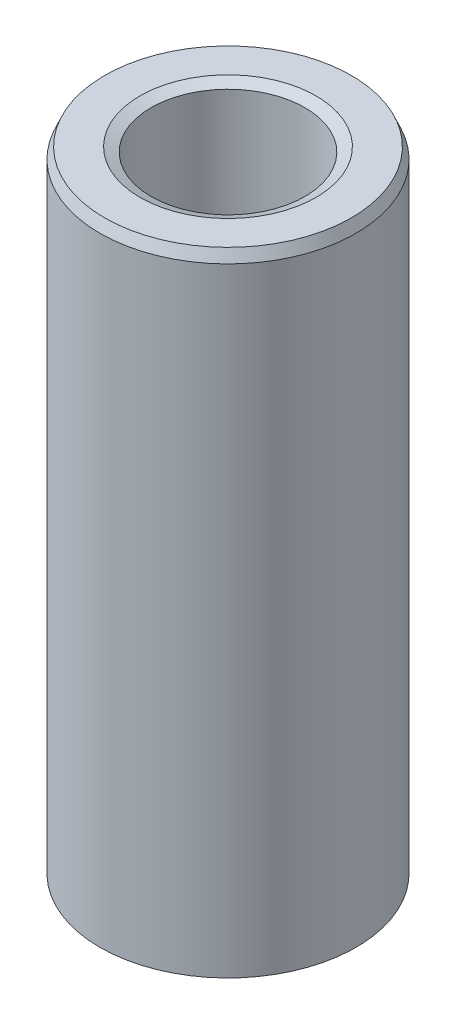
ISO-10303-21;
HEADER;
FILE_DESCRIPTION(('STEP AP214'),'2;1');
FILE_NAME('part.step','',(''),(''),'','','');
FILE_SCHEMA(('AUTOMOTIVE_DESIGN { 1 0 10303 214 1 1 1 1 }'));
ENDSEC;
DATA;
#1=APPLICATION_CONTEXT('core data for automotive mechanical design processes');
#2=APPLICATION_PROTOCOL_DEFINITION('international standard','automotive_design',2000,#1);
#3=PRODUCT_CONTEXT('',#1,'mechanical');
#4=PRODUCT('Part','Part','',(#3));
#5=PRODUCT_RELATED_PRODUCT_CATEGORY('part','',(#4));
#6=PRODUCT_DEFINITION_FORMATION('','',#4);
#7=PRODUCT_DEFINITION_CONTEXT('part definition',#1,'design');
#8=PRODUCT_DEFINITION('design','',#6,#7);
#9=PRODUCT_DEFINITION_SHAPE('','',#8);
#10=(LENGTH_UNIT() NAMED_UNIT(*) SI_UNIT(.MILLI.,.METRE.));
#11=(NAMED_UNIT(*) PLANE_ANGLE_UNIT() SI_UNIT($,.RADIAN.));
#12=(NAMED_UNIT(*) SI_UNIT($,.STERADIAN.) SOLID_ANGLE_UNIT());
#13=UNCERTAINTY_MEASURE_WITH_UNIT(LENGTH_MEASURE(1.E-05),#10,'distance_accuracy_value','');
#14=(GEOMETRIC_REPRESENTATION_CONTEXT(3) GLOBAL_UNCERTAINTY_ASSIGNED_CONTEXT((#13)) GLOBAL_UNIT_ASSIGNED_CONTEXT((#10,
#11,#12)) REPRESENTATION_CONTEXT('',''));
#15=CARTESIAN_POINT('',(0.,0.,0.));
#16=DIRECTION('',(0.,0.,1.));
#17=DIRECTION('',(1.,0.,0.));
#18=AXIS2_PLACEMENT_3D('',#15,#16,#17);
#19=CARTESIAN_POINT('',(0.,185.728124126698,0.));
#20=DIRECTION('',(0.,-1.,0.));
#21=DIRECTION('',(0.,0.,-1.));
#22=AXIS2_PLACEMENT_3D('',#19,#20,#21);
#23=CYLINDRICAL_SURFACE('',#22,37.5);
#24=CARTESIAN_POINT('',(0.,1.37318236492334,0.));
#25=DIRECTION('',(0.,1.,0.));
#26=DIRECTION('',(0.,0.,1.));
#27=AXIS2_PLACEMENT_3D('',#24,#25,#26);
#28=CIRCLE('',#27,37.5);
#29=CARTESIAN_POINT('',(0.,1.37318236492334,37.5));
#30=VERTEX_POINT('',#29);
#31=EDGE_CURVE('E10',#30,#30,#28,.T.);
#32=ORIENTED_EDGE('',*,*,#31,.T.);
#33=EDGE_LOOP('',(#32));
#34=FACE_BOUND('',#33,.T.);
#35=CARTESIAN_POINT('',(0.,182.495355527139,0.));
#36=DIRECTION('',(0.,1.,0.));
#37=DIRECTION('',(0.,0.,1.));
#38=AXIS2_PLACEMENT_3D('',#35,#36,#37);
#39=CIRCLE('',#38,37.5);
#40=CARTESIAN_POINT('',(0.,182.495355527139,37.5));
#41=VERTEX_POINT('',#40);
#42=EDGE_CURVE('E50',#41,#41,#39,.F.);
#43=ORIENTED_EDGE('',*,*,#42,.T.);
#44=EDGE_LOOP('',(#43));
#45=FACE_BOUND('',#44,.T.);
#46=ADVANCED_FACE('F39',(#34,#45),#23,.T.);
#47=CARTESIAN_POINT('',(0.,185.728124126698,0.));
#48=DIRECTION('',(0.,1.,0.));
#49=DIRECTION('',(0.,0.,1.));
#50=AXIS2_PLACEMENT_3D('',#47,#48,#49);
#51=PLANE('',#50);
#52=CARTESIAN_POINT('',(0.,185.728124126698,0.));
#53=DIRECTION('',(0.,1.,0.));
#54=DIRECTION('',(0.,0.,1.));
#55=AXIS2_PLACEMENT_3D('',#52,#53,#54);
#56=CIRCLE('',#55,25.7764049885454);
#57=CARTESIAN_POINT('',(0.,185.728124126698,25.7764049885454));
#58=VERTEX_POINT('',#57);
#59=EDGE_CURVE('E58',#58,#58,#56,.F.);
#60=ORIENTED_EDGE('',*,*,#59,.T.);
#61=EDGE_LOOP('',(#60));
#62=FACE_BOUND('',#61,.T.);
#63=CARTESIAN_POINT('',(0.,185.728124126698,0.));
#64=DIRECTION('',(0.,1.,0.));
#65=DIRECTION('',(0.,0.,1.));
#66=AXIS2_PLACEMENT_3D('',#63,#64,#65);
#67=CIRCLE('',#66,36.1268176350767);
#68=CARTESIAN_POINT('',(0.,185.728124126698,36.1268176350767));
#69=VERTEX_POINT('',#68);
#70=EDGE_CURVE('E61',#69,#69,#67,.T.);
#71=ORIENTED_EDGE('',*,*,#70,.T.);
#72=EDGE_LOOP('',(#71));
#73=FACE_BOUND('',#72,.T.);
#74=ADVANCED_FACE('F88',(#62,#73),#51,.T.);
#75=CARTESIAN_POINT('',(0.,0.,0.));
#76=DIRECTION('',(0.,1.,0.));
#77=DIRECTION('',(0.,0.,1.));
#78=AXIS2_PLACEMENT_3D('',#75,#76,#77);
#79=PLANE('',#78);
#80=CARTESIAN_POINT('',(0.,0.,0.));
#81=DIRECTION('',(0.,1.,0.));
#82=DIRECTION('',(0.,0.,1.));
#83=AXIS2_PLACEMENT_3D('',#80,#81,#82);
#84=CIRCLE('',#83,23.91681875391);
#85=CARTESIAN_POINT('',(0.,0.,23.91681875391));
#86=VERTEX_POINT('',#85);
#87=EDGE_CURVE('E51',#86,#86,#84,.T.);
#88=ORIENTED_EDGE('',*,*,#87,.T.);
#89=EDGE_LOOP('',(#88));
#90=FACE_BOUND('',#89,.T.);
#91=CARTESIAN_POINT('',(0.,0.,0.));
#92=DIRECTION('',(0.,1.,0.));
#93=DIRECTION('',(0.,0.,1.));
#94=AXIS2_PLACEMENT_3D('',#91,#92,#93);
#95=CIRCLE('',#94,34.2672314004412);
#96=CARTESIAN_POINT('',(0.,0.,34.2672314004412));
#97=VERTEX_POINT('',#96);
#98=EDGE_CURVE('E54',#97,#97,#95,.F.);
#99=ORIENTED_EDGE('',*,*,#98,.T.);
#100=EDGE_LOOP('',(#99));
#101=FACE_BOUND('',#100,.T.);
#102=ADVANCED_FACE('F83',(#90,#101),#79,.F.);
#103=CARTESIAN_POINT('',(0.,185.728124126698,0.));
#104=DIRECTION('',(0.,-1.,0.));
#105=DIRECTION('',(0.,0.,-1.));
#106=AXIS2_PLACEMENT_3D('',#103,#104,#105);
#107=CYLINDRICAL_SURFACE('',#106,22.5436363889867);
#108=CARTESIAN_POINT('',(0.,184.354941761775,0.));
#109=DIRECTION('',(0.,1.,0.));
#110=DIRECTION('',(0.,0.,1.));
#111=AXIS2_PLACEMENT_3D('',#108,#109,#110);
#112=CIRCLE('',#111,22.5436363889867);
#113=CARTESIAN_POINT('',(0.,184.354941761775,22.5436363889867));
#114=VERTEX_POINT('',#113);
#115=EDGE_CURVE('E67',#114,#114,#112,.T.);
#116=ORIENTED_EDGE('',*,*,#115,.T.);
#117=EDGE_LOOP('',(#116));
#118=FACE_BOUND('',#117,.T.);
#119=CARTESIAN_POINT('',(0.,3.23276859955884,0.));
#120=DIRECTION('',(0.,1.,0.));
#121=DIRECTION('',(0.,0.,1.));
#122=AXIS2_PLACEMENT_3D('',#119,#120,#121);
#123=CIRCLE('',#122,22.5436363889867);
#124=CARTESIAN_POINT('',(0.,3.23276859955884,22.5436363889867));
#125=VERTEX_POINT('',#124);
#126=EDGE_CURVE('E69',#125,#125,#123,.F.);
#127=ORIENTED_EDGE('',*,*,#126,.T.);
#128=EDGE_LOOP('',(#127));
#129=FACE_BOUND('',#128,.T.);
#130=ADVANCED_FACE('F71',(#118,#129),#107,.F.);
#131=CARTESIAN_POINT('',(0.,184.354941761775,0.));
#132=DIRECTION('',(0.,1.,0.));
#133=DIRECTION('',(0.,0.,1.));
#134=AXIS2_PLACEMENT_3D('',#131,#132,#133);
#135=CONICAL_SURFACE('',#134,22.5436363889867,1.16912070490601);
#136=ORIENTED_EDGE('',*,*,#59,.F.);
#137=EDGE_LOOP('',(#136));
#138=FACE_BOUND('',#137,.T.);
#139=ORIENTED_EDGE('',*,*,#115,.F.);
#140=EDGE_LOOP('',(#139));
#141=FACE_BOUND('',#140,.T.);
#142=ADVANCED_FACE('F77',(#138,#141),#135,.F.);
#143=CARTESIAN_POINT('',(0.,0.,0.));
#144=DIRECTION('',(0.,-1.,0.));
#145=DIRECTION('',(0.,0.,-1.));
#146=AXIS2_PLACEMENT_3D('',#143,#144,#145);
#147=CONICAL_SURFACE('',#146,23.91681875391,0.401675621888879);
#148=ORIENTED_EDGE('',*,*,#126,.F.);
#149=EDGE_LOOP('',(#148));
#150=FACE_BOUND('',#149,.T.);
#151=ORIENTED_EDGE('',*,*,#87,.F.);
#152=EDGE_LOOP('',(#151));
#153=FACE_BOUND('',#152,.T.);
#154=ADVANCED_FACE('F73',(#150,#153),#147,.F.);
#155=CARTESIAN_POINT('',(0.,1.37318236492334,0.));
#156=DIRECTION('',(0.,1.,0.));
#157=DIRECTION('',(0.,0.,1.));
#158=AXIS2_PLACEMENT_3D('',#155,#156,#157);
#159=CONICAL_SURFACE('',#158,37.5,1.16912070490602);
#160=ORIENTED_EDGE('',*,*,#98,.F.);
#161=EDGE_LOOP('',(#160));
#162=FACE_BOUND('',#161,.T.);
#163=ORIENTED_EDGE('',*,*,#31,.F.);
#164=EDGE_LOOP('',(#163));
#165=FACE_BOUND('',#164,.T.);
#166=ADVANCED_FACE('F76',(#162,#165),#159,.T.);
#167=CARTESIAN_POINT('',(0.,185.728124126698,0.));
#168=DIRECTION('',(0.,-1.,0.));
#169=DIRECTION('',(0.,0.,-1.));
#170=AXIS2_PLACEMENT_3D('',#167,#168,#169);
#171=CONICAL_SURFACE('',#170,36.1268176350767,0.40167562188888);
#172=ORIENTED_EDGE('',*,*,#42,.F.);
#173=EDGE_LOOP('',(#172));
#174=FACE_BOUND('',#173,.T.);
#175=ORIENTED_EDGE('',*,*,#70,.F.);
#176=EDGE_LOOP('',(#175));
#177=FACE_BOUND('',#176,.T.);
#178=ADVANCED_FACE('F45',(#174,#177),#171,.T.);
#179=CLOSED_SHELL('',(#46,#74,#102,#130,#142,#154,#166,#178));
#180=MANIFOLD_SOLID_BREP('B2',#179);
#181=ADVANCED_BREP_SHAPE_REPRESENTATION('',(#18,#180),#14);
#182=SHAPE_DEFINITION_REPRESENTATION(#9,#181);
ENDSEC;
END-ISO-10303-21;
